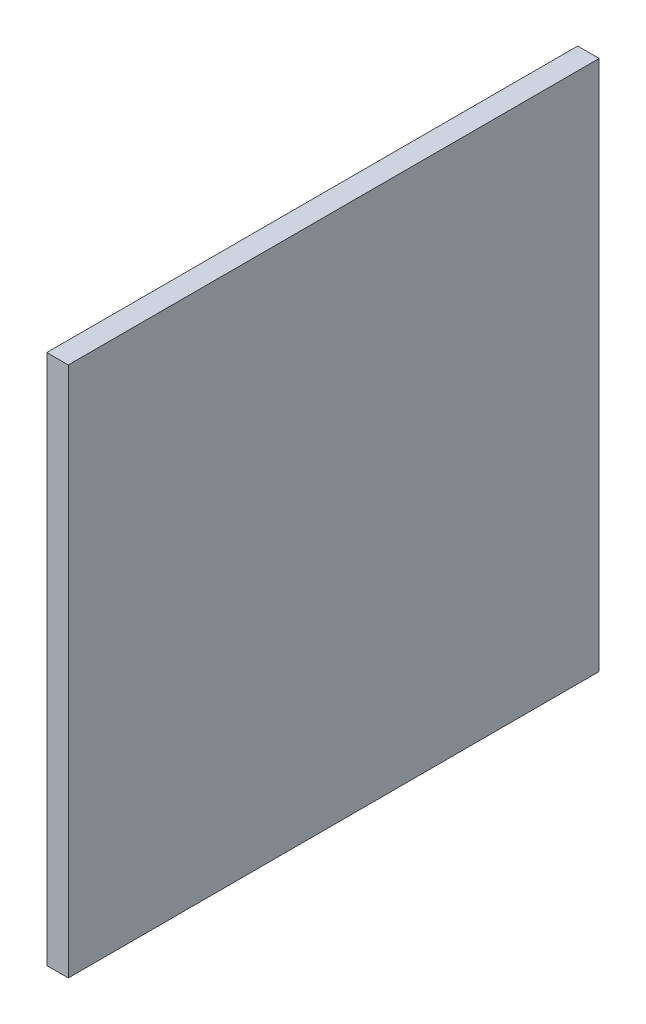
ISO-10303-21;
HEADER;
FILE_DESCRIPTION(('STEP AP214'),'2;1');
FILE_NAME('part.step','',(''),(''),'','','');
FILE_SCHEMA(('AUTOMOTIVE_DESIGN { 1 0 10303 214 1 1 1 1 }'));
ENDSEC;
DATA;
#1=APPLICATION_CONTEXT('core data for automotive mechanical design processes');
#2=APPLICATION_PROTOCOL_DEFINITION('international standard','automotive_design',2000,#1);
#3=PRODUCT_CONTEXT('',#1,'mechanical');
#4=PRODUCT('Part','Part','',(#3));
#5=PRODUCT_RELATED_PRODUCT_CATEGORY('part','',(#4));
#6=PRODUCT_DEFINITION_FORMATION('','',#4);
#7=PRODUCT_DEFINITION_CONTEXT('part definition',#1,'design');
#8=PRODUCT_DEFINITION('design','',#6,#7);
#9=PRODUCT_DEFINITION_SHAPE('','',#8);
#10=(LENGTH_UNIT() NAMED_UNIT(*) SI_UNIT(.MILLI.,.METRE.));
#11=(NAMED_UNIT(*) PLANE_ANGLE_UNIT() SI_UNIT($,.RADIAN.));
#12=(NAMED_UNIT(*) SI_UNIT($,.STERADIAN.) SOLID_ANGLE_UNIT());
#13=UNCERTAINTY_MEASURE_WITH_UNIT(LENGTH_MEASURE(1.E-05),#10,'distance_accuracy_value','');
#14=(GEOMETRIC_REPRESENTATION_CONTEXT(3) GLOBAL_UNCERTAINTY_ASSIGNED_CONTEXT((#13)) GLOBAL_UNIT_ASSIGNED_CONTEXT((#10,
#11,#12)) REPRESENTATION_CONTEXT('',''));
#15=CARTESIAN_POINT('',(0.,0.,0.));
#16=DIRECTION('',(0.,0.,1.));
#17=DIRECTION('',(1.,0.,0.));
#18=AXIS2_PLACEMENT_3D('',#15,#16,#17);
#19=CARTESIAN_POINT('',(-3.,-37.,37.));
#20=DIRECTION('',(0.,0.,1.));
#21=DIRECTION('',(1.,0.,0.));
#22=AXIS2_PLACEMENT_3D('',#19,#20,#21);
#23=PLANE('',#22);
#24=DIRECTION('',(0.,-1.,0.));
#25=VECTOR('',#24,1.);
#26=CARTESIAN_POINT('',(0.,-37.,37.));
#27=LINE('',#26,#25);
#28=CARTESIAN_POINT('',(0.,37.,37.));
#29=VERTEX_POINT('',#28);
#30=CARTESIAN_POINT('',(0.,-37.,37.));
#31=VERTEX_POINT('',#30);
#32=EDGE_CURVE('E114',#29,#31,#27,.T.);
#33=ORIENTED_EDGE('',*,*,#32,.F.);
#34=DIRECTION('',(1.,0.,0.));
#35=VECTOR('',#34,1.);
#36=CARTESIAN_POINT('',(-3.,37.,37.));
#37=LINE('',#36,#35);
#38=CARTESIAN_POINT('',(-3.,37.,37.));
#39=VERTEX_POINT('',#38);
#40=EDGE_CURVE('E11',#39,#29,#37,.T.);
#41=ORIENTED_EDGE('',*,*,#40,.F.);
#42=DIRECTION('',(0.,-1.,0.));
#43=VECTOR('',#42,1.);
#44=CARTESIAN_POINT('',(-3.,-37.,37.));
#45=LINE('',#44,#43);
#46=CARTESIAN_POINT('',(-3.,-37.,37.));
#47=VERTEX_POINT('',#46);
#48=EDGE_CURVE('E104',#39,#47,#45,.T.);
#49=ORIENTED_EDGE('',*,*,#48,.T.);
#50=DIRECTION('',(1.,0.,0.));
#51=VECTOR('',#50,1.);
#52=CARTESIAN_POINT('',(-3.,-37.,37.));
#53=LINE('',#52,#51);
#54=EDGE_CURVE('E45',#47,#31,#53,.T.);
#55=ORIENTED_EDGE('',*,*,#54,.T.);
#56=EDGE_LOOP('',(#33,#41,#49,#55));
#57=FACE_BOUND('',#56,.T.);
#58=ADVANCED_FACE('F42',(#57),#23,.T.);
#59=CARTESIAN_POINT('',(-3.,37.,-37.));
#60=DIRECTION('',(0.,1.,0.));
#61=DIRECTION('',(0.,0.,1.));
#62=AXIS2_PLACEMENT_3D('',#59,#60,#61);
#63=PLANE('',#62);
#64=DIRECTION('',(0.,0.,1.));
#65=VECTOR('',#64,1.);
#66=CARTESIAN_POINT('',(0.,37.,-37.));
#67=LINE('',#66,#65);
#68=CARTESIAN_POINT('',(0.,37.,-37.));
#69=VERTEX_POINT('',#68);
#70=EDGE_CURVE('E109',#69,#29,#67,.T.);
#71=ORIENTED_EDGE('',*,*,#70,.F.);
#72=DIRECTION('',(1.,0.,0.));
#73=VECTOR('',#72,1.);
#74=CARTESIAN_POINT('',(-3.,37.,-37.));
#75=LINE('',#74,#73);
#76=CARTESIAN_POINT('',(-3.,37.,-37.));
#77=VERTEX_POINT('',#76);
#78=EDGE_CURVE('E52',#77,#69,#75,.T.);
#79=ORIENTED_EDGE('',*,*,#78,.F.);
#80=DIRECTION('',(0.,0.,1.));
#81=VECTOR('',#80,1.);
#82=CARTESIAN_POINT('',(-3.,37.,-37.));
#83=LINE('',#82,#81);
#84=EDGE_CURVE('E99',#77,#39,#83,.T.);
#85=ORIENTED_EDGE('',*,*,#84,.T.);
#86=ORIENTED_EDGE('',*,*,#40,.T.);
#87=EDGE_LOOP('',(#71,#79,#85,#86));
#88=FACE_BOUND('',#87,.T.);
#89=ADVANCED_FACE('F140',(#88),#63,.T.);
#90=CARTESIAN_POINT('',(-3.,-37.,-37.));
#91=DIRECTION('',(0.,0.,-1.));
#92=DIRECTION('',(-1.,0.,0.));
#93=AXIS2_PLACEMENT_3D('',#90,#91,#92);
#94=PLANE('',#93);
#95=DIRECTION('',(0.,1.,0.));
#96=VECTOR('',#95,1.);
#97=CARTESIAN_POINT('',(0.,-37.,-37.));
#98=LINE('',#97,#96);
#99=CARTESIAN_POINT('',(0.,-37.,-37.));
#100=VERTEX_POINT('',#99);
#101=EDGE_CURVE('E93',#100,#69,#98,.T.);
#102=ORIENTED_EDGE('',*,*,#101,.F.);
#103=DIRECTION('',(1.,0.,0.));
#104=VECTOR('',#103,1.);
#105=CARTESIAN_POINT('',(-3.,-37.,-37.));
#106=LINE('',#105,#104);
#107=CARTESIAN_POINT('',(-3.,-37.,-37.));
#108=VERTEX_POINT('',#107);
#109=EDGE_CURVE('E88',#108,#100,#106,.T.);
#110=ORIENTED_EDGE('',*,*,#109,.F.);
#111=DIRECTION('',(0.,1.,0.));
#112=VECTOR('',#111,1.);
#113=CARTESIAN_POINT('',(-3.,-37.,-37.));
#114=LINE('',#113,#112);
#115=EDGE_CURVE('E91',#108,#77,#114,.T.);
#116=ORIENTED_EDGE('',*,*,#115,.T.);
#117=ORIENTED_EDGE('',*,*,#78,.T.);
#118=EDGE_LOOP('',(#102,#110,#116,#117));
#119=FACE_BOUND('',#118,.T.);
#120=ADVANCED_FACE('F90',(#119),#94,.T.);
#121=CARTESIAN_POINT('',(-3.,-37.,-37.));
#122=DIRECTION('',(0.,-1.,0.));
#123=DIRECTION('',(0.,0.,-1.));
#124=AXIS2_PLACEMENT_3D('',#121,#122,#123);
#125=PLANE('',#124);
#126=DIRECTION('',(0.,0.,-1.));
#127=VECTOR('',#126,1.);
#128=CARTESIAN_POINT('',(0.,-37.,-37.));
#129=LINE('',#128,#127);
#130=EDGE_CURVE('E118',#31,#100,#129,.T.);
#131=ORIENTED_EDGE('',*,*,#130,.F.);
#132=ORIENTED_EDGE('',*,*,#54,.F.);
#133=DIRECTION('',(0.,0.,-1.));
#134=VECTOR('',#133,1.);
#135=CARTESIAN_POINT('',(-3.,-37.,-37.));
#136=LINE('',#135,#134);
#137=EDGE_CURVE('E98',#47,#108,#136,.T.);
#138=ORIENTED_EDGE('',*,*,#137,.T.);
#139=ORIENTED_EDGE('',*,*,#109,.T.);
#140=EDGE_LOOP('',(#131,#132,#138,#139));
#141=FACE_BOUND('',#140,.T.);
#142=ADVANCED_FACE('F102',(#141),#125,.T.);
#143=CARTESIAN_POINT('',(-3.,0.,0.));
#144=DIRECTION('',(1.,0.,0.));
#145=DIRECTION('',(0.,0.,-1.));
#146=AXIS2_PLACEMENT_3D('',#143,#144,#145);
#147=PLANE('',#146);
#148=ORIENTED_EDGE('',*,*,#48,.F.);
#149=ORIENTED_EDGE('',*,*,#84,.F.);
#150=ORIENTED_EDGE('',*,*,#115,.F.);
#151=ORIENTED_EDGE('',*,*,#137,.F.);
#152=EDGE_LOOP('',(#148,#149,#150,#151));
#153=FACE_BOUND('',#152,.T.);
#154=ADVANCED_FACE('F97',(#153),#147,.F.);
#155=CARTESIAN_POINT('',(0.,0.,0.));
#156=DIRECTION('',(1.,0.,0.));
#157=DIRECTION('',(0.,0.,-1.));
#158=AXIS2_PLACEMENT_3D('',#155,#156,#157);
#159=PLANE('',#158);
#160=ORIENTED_EDGE('',*,*,#32,.T.);
#161=ORIENTED_EDGE('',*,*,#130,.T.);
#162=ORIENTED_EDGE('',*,*,#101,.T.);
#163=ORIENTED_EDGE('',*,*,#70,.T.);
#164=EDGE_LOOP('',(#160,#161,#162,#163));
#165=FACE_BOUND('',#164,.T.);
#166=ADVANCED_FACE('F139',(#165),#159,.T.);
#167=CLOSED_SHELL('',(#58,#89,#120,#142,#154,#166));
#168=MANIFOLD_SOLID_BREP('B2',#167);
#169=ADVANCED_BREP_SHAPE_REPRESENTATION('',(#18,#168),#14);
#170=SHAPE_DEFINITION_REPRESENTATION(#9,#169);
ENDSEC;
END-ISO-10303-21;
